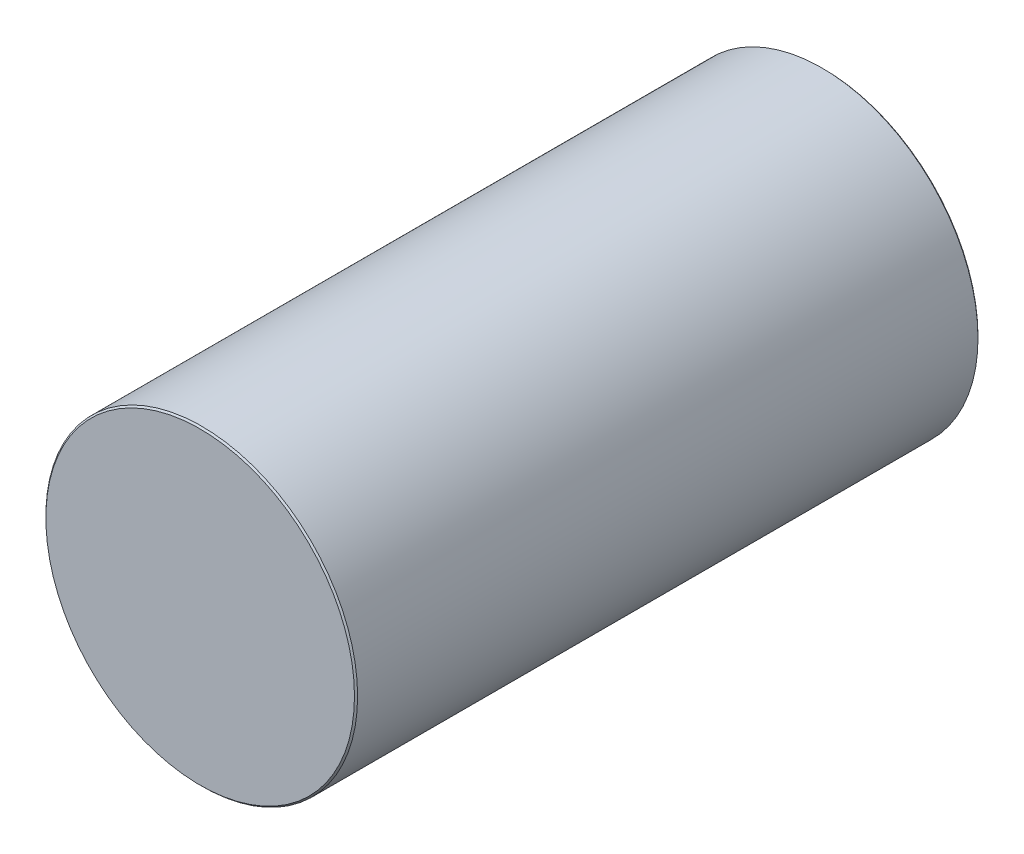
ISO-10303-21;
HEADER;
FILE_DESCRIPTION(('STEP AP214'),'2;1');
FILE_NAME('part.step','',(''),(''),'','','');
FILE_SCHEMA(('AUTOMOTIVE_DESIGN { 1 0 10303 214 1 1 1 1 }'));
ENDSEC;
DATA;
#1=APPLICATION_CONTEXT('core data for automotive mechanical design processes');
#2=APPLICATION_PROTOCOL_DEFINITION('international standard','automotive_design',2000,#1);
#3=PRODUCT_CONTEXT('',#1,'mechanical');
#4=PRODUCT('Part','Part','',(#3));
#5=PRODUCT_RELATED_PRODUCT_CATEGORY('part','',(#4));
#6=PRODUCT_DEFINITION_FORMATION('','',#4);
#7=PRODUCT_DEFINITION_CONTEXT('part definition',#1,'design');
#8=PRODUCT_DEFINITION('design','',#6,#7);
#9=PRODUCT_DEFINITION_SHAPE('','',#8);
#10=(LENGTH_UNIT() NAMED_UNIT(*) SI_UNIT(.MILLI.,.METRE.));
#11=(NAMED_UNIT(*) PLANE_ANGLE_UNIT() SI_UNIT($,.RADIAN.));
#12=(NAMED_UNIT(*) SI_UNIT($,.STERADIAN.) SOLID_ANGLE_UNIT());
#13=UNCERTAINTY_MEASURE_WITH_UNIT(LENGTH_MEASURE(1.E-05),#10,'distance_accuracy_value','');
#14=(GEOMETRIC_REPRESENTATION_CONTEXT(3) GLOBAL_UNCERTAINTY_ASSIGNED_CONTEXT((#13)) GLOBAL_UNIT_ASSIGNED_CONTEXT((#10,
#11,#12)) REPRESENTATION_CONTEXT('',''));
#15=CARTESIAN_POINT('',(0.,0.,0.));
#16=DIRECTION('',(0.,0.,1.));
#17=DIRECTION('',(1.,0.,0.));
#18=AXIS2_PLACEMENT_3D('',#15,#16,#17);
#19=CARTESIAN_POINT('',(0.,0.,400.));
#20=DIRECTION('',(0.,0.,-1.));
#21=DIRECTION('',(-1.,0.,0.));
#22=AXIS2_PLACEMENT_3D('',#19,#20,#21);
#23=CYLINDRICAL_SURFACE('',#22,100.);
#24=CARTESIAN_POINT('',(0.,0.,1.));
#25=DIRECTION('',(0.,0.,1.));
#26=DIRECTION('',(1.,0.,0.));
#27=AXIS2_PLACEMENT_3D('',#24,#25,#26);
#28=CIRCLE('',#27,100.);
#29=CARTESIAN_POINT('',(100.,0.,1.));
#30=VERTEX_POINT('',#29);
#31=EDGE_CURVE('E45',#30,#30,#28,.T.);
#32=ORIENTED_EDGE('',*,*,#31,.T.);
#33=EDGE_LOOP('',(#32));
#34=FACE_BOUND('',#33,.T.);
#35=CARTESIAN_POINT('',(0.,0.,399.));
#36=DIRECTION('',(0.,0.,1.));
#37=DIRECTION('',(1.,0.,0.));
#38=AXIS2_PLACEMENT_3D('',#35,#36,#37);
#39=CIRCLE('',#38,100.);
#40=CARTESIAN_POINT('',(100.,0.,399.));
#41=VERTEX_POINT('',#40);
#42=EDGE_CURVE('E49',#41,#41,#39,.F.);
#43=ORIENTED_EDGE('',*,*,#42,.T.);
#44=EDGE_LOOP('',(#43));
#45=FACE_BOUND('',#44,.T.);
#46=ADVANCED_FACE('F34',(#34,#45),#23,.T.);
#47=CARTESIAN_POINT('',(0.,0.,400.));
#48=DIRECTION('',(0.,0.,1.));
#49=DIRECTION('',(1.,0.,0.));
#50=AXIS2_PLACEMENT_3D('',#47,#48,#49);
#51=PLANE('',#50);
#52=CARTESIAN_POINT('',(0.,0.,400.));
#53=DIRECTION('',(0.,0.,1.));
#54=DIRECTION('',(1.,0.,0.));
#55=AXIS2_PLACEMENT_3D('',#52,#53,#54);
#56=CIRCLE('',#55,99.);
#57=CARTESIAN_POINT('',(99.,0.,400.));
#58=VERTEX_POINT('',#57);
#59=EDGE_CURVE('E10',#58,#58,#56,.T.);
#60=ORIENTED_EDGE('',*,*,#59,.T.);
#61=EDGE_LOOP('',(#60));
#62=FACE_BOUND('',#61,.T.);
#63=ADVANCED_FACE('F65',(#62),#51,.T.);
#64=CARTESIAN_POINT('',(0.,0.,0.));
#65=DIRECTION('',(0.,0.,1.));
#66=DIRECTION('',(1.,0.,0.));
#67=AXIS2_PLACEMENT_3D('',#64,#65,#66);
#68=PLANE('',#67);
#69=CARTESIAN_POINT('',(0.,0.,0.));
#70=DIRECTION('',(0.,0.,1.));
#71=DIRECTION('',(1.,0.,0.));
#72=AXIS2_PLACEMENT_3D('',#69,#70,#71);
#73=CIRCLE('',#72,99.);
#74=CARTESIAN_POINT('',(99.,0.,0.));
#75=VERTEX_POINT('',#74);
#76=EDGE_CURVE('E41',#75,#75,#73,.F.);
#77=ORIENTED_EDGE('',*,*,#76,.T.);
#78=EDGE_LOOP('',(#77));
#79=FACE_BOUND('',#78,.T.);
#80=ADVANCED_FACE('F62',(#79),#68,.F.);
#81=CARTESIAN_POINT('',(0.,0.,1.));
#82=DIRECTION('',(0.,0.,1.));
#83=DIRECTION('',(1.,0.,0.));
#84=AXIS2_PLACEMENT_3D('',#81,#82,#83);
#85=CONICAL_SURFACE('',#84,100.,0.785398163397448);
#86=ORIENTED_EDGE('',*,*,#76,.F.);
#87=EDGE_LOOP('',(#86));
#88=FACE_BOUND('',#87,.T.);
#89=ORIENTED_EDGE('',*,*,#31,.F.);
#90=EDGE_LOOP('',(#89));
#91=FACE_BOUND('',#90,.T.);
#92=ADVANCED_FACE('F58',(#88,#91),#85,.T.);
#93=CARTESIAN_POINT('',(0.,0.,400.));
#94=DIRECTION('',(0.,0.,-1.));
#95=DIRECTION('',(-1.,0.,0.));
#96=AXIS2_PLACEMENT_3D('',#93,#94,#95);
#97=CONICAL_SURFACE('',#96,99.,0.78539816339749);
#98=ORIENTED_EDGE('',*,*,#42,.F.);
#99=EDGE_LOOP('',(#98));
#100=FACE_BOUND('',#99,.T.);
#101=ORIENTED_EDGE('',*,*,#59,.F.);
#102=EDGE_LOOP('',(#101));
#103=FACE_BOUND('',#102,.T.);
#104=ADVANCED_FACE('F36',(#100,#103),#97,.T.);
#105=CLOSED_SHELL('',(#46,#63,#80,#92,#104));
#106=MANIFOLD_SOLID_BREP('B2',#105);
#107=ADVANCED_BREP_SHAPE_REPRESENTATION('',(#18,#106),#14);
#108=SHAPE_DEFINITION_REPRESENTATION(#9,#107);
ENDSEC;
END-ISO-10303-21;
